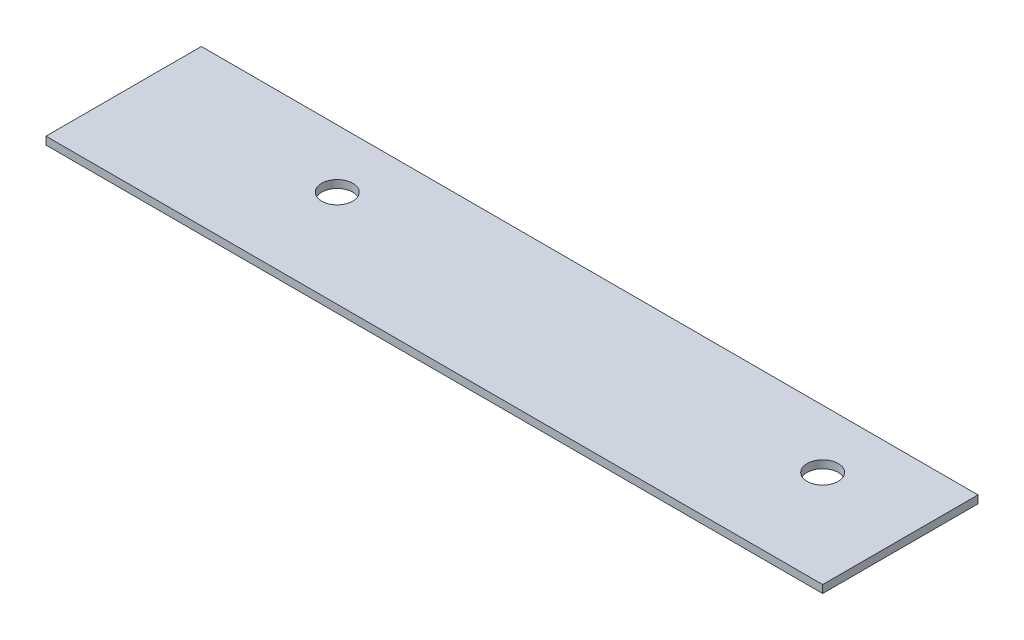
ISO-10303-21;
HEADER;
FILE_DESCRIPTION(('STEP AP214'),'2;1');
FILE_NAME('part.step','',(''),(''),'','','');
FILE_SCHEMA(('AUTOMOTIVE_DESIGN { 1 0 10303 214 1 1 1 1 }'));
ENDSEC;
DATA;
#1=APPLICATION_CONTEXT('core data for automotive mechanical design processes');
#2=APPLICATION_PROTOCOL_DEFINITION('international standard','automotive_design',2000,#1);
#3=PRODUCT_CONTEXT('',#1,'mechanical');
#4=PRODUCT('Part','Part','',(#3));
#5=PRODUCT_RELATED_PRODUCT_CATEGORY('part','',(#4));
#6=PRODUCT_DEFINITION_FORMATION('','',#4);
#7=PRODUCT_DEFINITION_CONTEXT('part definition',#1,'design');
#8=PRODUCT_DEFINITION('design','',#6,#7);
#9=PRODUCT_DEFINITION_SHAPE('','',#8);
#10=(LENGTH_UNIT() NAMED_UNIT(*) SI_UNIT(.MILLI.,.METRE.));
#11=(NAMED_UNIT(*) PLANE_ANGLE_UNIT() SI_UNIT($,.RADIAN.));
#12=(NAMED_UNIT(*) SI_UNIT($,.STERADIAN.) SOLID_ANGLE_UNIT());
#13=UNCERTAINTY_MEASURE_WITH_UNIT(LENGTH_MEASURE(1.E-05),#10,'distance_accuracy_value','');
#14=(GEOMETRIC_REPRESENTATION_CONTEXT(3) GLOBAL_UNCERTAINTY_ASSIGNED_CONTEXT((#13)) GLOBAL_UNIT_ASSIGNED_CONTEXT((#10,
#11,#12)) REPRESENTATION_CONTEXT('',''));
#15=CARTESIAN_POINT('',(0.,0.,0.));
#16=DIRECTION('',(0.,0.,1.));
#17=DIRECTION('',(1.,0.,0.));
#18=AXIS2_PLACEMENT_3D('',#15,#16,#17);
#19=CARTESIAN_POINT('',(0.,0.8,0.));
#20=DIRECTION('',(0.,-1.,0.));
#21=DIRECTION('',(0.,0.,-1.));
#22=AXIS2_PLACEMENT_3D('',#19,#20,#21);
#23=PLANE('',#22);
#24=DIRECTION('',(0.,0.,1.));
#25=VECTOR('',#24,1.);
#26=CARTESIAN_POINT('',(0.,0.8,0.));
#27=LINE('',#26,#25);
#28=CARTESIAN_POINT('',(0.,0.8,-16.));
#29=VERTEX_POINT('',#28);
#30=CARTESIAN_POINT('',(0.,0.8,0.));
#31=VERTEX_POINT('',#30);
#32=EDGE_CURVE('E85',#29,#31,#27,.T.);
#33=ORIENTED_EDGE('',*,*,#32,.T.);
#34=DIRECTION('',(1.,0.,0.));
#35=VECTOR('',#34,1.);
#36=CARTESIAN_POINT('',(0.,0.8,0.));
#37=LINE('',#36,#35);
#38=CARTESIAN_POINT('',(80.,0.8,0.));
#39=VERTEX_POINT('',#38);
#40=EDGE_CURVE('E80',#31,#39,#37,.T.);
#41=ORIENTED_EDGE('',*,*,#40,.T.);
#42=DIRECTION('',(0.,0.,-1.));
#43=VECTOR('',#42,1.);
#44=CARTESIAN_POINT('',(80.,0.8,0.));
#45=LINE('',#44,#43);
#46=CARTESIAN_POINT('',(80.,0.8,-16.));
#47=VERTEX_POINT('',#46);
#48=EDGE_CURVE('E83',#39,#47,#45,.T.);
#49=ORIENTED_EDGE('',*,*,#48,.T.);
#50=DIRECTION('',(-1.,0.,0.));
#51=VECTOR('',#50,1.);
#52=CARTESIAN_POINT('',(0.,0.8,-16.));
#53=LINE('',#52,#51);
#54=EDGE_CURVE('E50',#47,#29,#53,.T.);
#55=ORIENTED_EDGE('',*,*,#54,.T.);
#56=EDGE_LOOP('',(#33,#41,#49,#55));
#57=FACE_BOUND('',#56,.T.);
#58=CARTESIAN_POINT('',(20.,0.8,-10.));
#59=DIRECTION('',(0.,1.,0.));
#60=DIRECTION('',(0.,0.,1.));
#61=AXIS2_PLACEMENT_3D('',#58,#59,#60);
#62=CIRCLE('',#61,1.6);
#63=CARTESIAN_POINT('',(20.,0.8,-8.4));
#64=VERTEX_POINT('',#63);
#65=EDGE_CURVE('E100',#64,#64,#62,.T.);
#66=ORIENTED_EDGE('',*,*,#65,.F.);
#67=EDGE_LOOP('',(#66));
#68=FACE_BOUND('',#67,.T.);
#69=CARTESIAN_POINT('',(70.,0.8,-10.));
#70=DIRECTION('',(0.,1.,0.));
#71=DIRECTION('',(0.,0.,1.));
#72=AXIS2_PLACEMENT_3D('',#69,#70,#71);
#73=CIRCLE('',#72,1.6);
#74=CARTESIAN_POINT('',(70.,0.8,-8.4));
#75=VERTEX_POINT('',#74);
#76=EDGE_CURVE('E115',#75,#75,#73,.T.);
#77=ORIENTED_EDGE('',*,*,#76,.F.);
#78=EDGE_LOOP('',(#77));
#79=FACE_BOUND('',#78,.T.);
#80=ADVANCED_FACE('F33',(#57,#68,#79),#23,.F.);
#81=CARTESIAN_POINT('',(0.,0.,0.));
#82=DIRECTION('',(0.,-1.,0.));
#83=DIRECTION('',(0.,0.,-1.));
#84=AXIS2_PLACEMENT_3D('',#81,#82,#83);
#85=PLANE('',#84);
#86=CARTESIAN_POINT('',(20.,0.,-10.));
#87=DIRECTION('',(0.,1.,0.));
#88=DIRECTION('',(0.,0.,1.));
#89=AXIS2_PLACEMENT_3D('',#86,#87,#88);
#90=CIRCLE('',#89,1.6);
#91=CARTESIAN_POINT('',(20.,0.,-8.4));
#92=VERTEX_POINT('',#91);
#93=EDGE_CURVE('E112',#92,#92,#90,.T.);
#94=ORIENTED_EDGE('',*,*,#93,.T.);
#95=EDGE_LOOP('',(#94));
#96=FACE_BOUND('',#95,.T.);
#97=DIRECTION('',(0.,0.,1.));
#98=VECTOR('',#97,1.);
#99=CARTESIAN_POINT('',(0.,0.,0.));
#100=LINE('',#99,#98);
#101=CARTESIAN_POINT('',(0.,0.,-16.));
#102=VERTEX_POINT('',#101);
#103=CARTESIAN_POINT('',(0.,0.,0.));
#104=VERTEX_POINT('',#103);
#105=EDGE_CURVE('E97',#102,#104,#100,.T.);
#106=ORIENTED_EDGE('',*,*,#105,.F.);
#107=DIRECTION('',(-1.,0.,0.));
#108=VECTOR('',#107,1.);
#109=CARTESIAN_POINT('',(0.,0.,-16.));
#110=LINE('',#109,#108);
#111=CARTESIAN_POINT('',(80.,0.,-16.));
#112=VERTEX_POINT('',#111);
#113=EDGE_CURVE('E73',#112,#102,#110,.T.);
#114=ORIENTED_EDGE('',*,*,#113,.F.);
#115=DIRECTION('',(0.,0.,-1.));
#116=VECTOR('',#115,1.);
#117=CARTESIAN_POINT('',(80.,0.,0.));
#118=LINE('',#117,#116);
#119=CARTESIAN_POINT('',(80.,0.,0.));
#120=VERTEX_POINT('',#119);
#121=EDGE_CURVE('E67',#120,#112,#118,.T.);
#122=ORIENTED_EDGE('',*,*,#121,.F.);
#123=DIRECTION('',(1.,0.,0.));
#124=VECTOR('',#123,1.);
#125=CARTESIAN_POINT('',(0.,0.,0.));
#126=LINE('',#125,#124);
#127=EDGE_CURVE('E89',#104,#120,#126,.T.);
#128=ORIENTED_EDGE('',*,*,#127,.F.);
#129=EDGE_LOOP('',(#106,#114,#122,#128));
#130=FACE_BOUND('',#129,.T.);
#131=CARTESIAN_POINT('',(70.,0.,-10.));
#132=DIRECTION('',(0.,1.,0.));
#133=DIRECTION('',(0.,0.,1.));
#134=AXIS2_PLACEMENT_3D('',#131,#132,#133);
#135=CIRCLE('',#134,1.6);
#136=CARTESIAN_POINT('',(70.,0.,-8.4));
#137=VERTEX_POINT('',#136);
#138=EDGE_CURVE('E118',#137,#137,#135,.T.);
#139=ORIENTED_EDGE('',*,*,#138,.T.);
#140=EDGE_LOOP('',(#139));
#141=FACE_BOUND('',#140,.T.);
#142=ADVANCED_FACE('F108',(#96,#130,#141),#85,.T.);
#143=CARTESIAN_POINT('',(0.,0.8,0.));
#144=DIRECTION('',(1.,0.,0.));
#145=DIRECTION('',(0.,0.,-1.));
#146=AXIS2_PLACEMENT_3D('',#143,#144,#145);
#147=PLANE('',#146);
#148=ORIENTED_EDGE('',*,*,#105,.T.);
#149=DIRECTION('',(0.,-1.,0.));
#150=VECTOR('',#149,1.);
#151=CARTESIAN_POINT('',(0.,0.8,0.));
#152=LINE('',#151,#150);
#153=EDGE_CURVE('E11',#31,#104,#152,.T.);
#154=ORIENTED_EDGE('',*,*,#153,.F.);
#155=ORIENTED_EDGE('',*,*,#32,.F.);
#156=DIRECTION('',(0.,-1.,0.));
#157=VECTOR('',#156,1.);
#158=CARTESIAN_POINT('',(0.,0.8,-16.));
#159=LINE('',#158,#157);
#160=EDGE_CURVE('E93',#29,#102,#159,.T.);
#161=ORIENTED_EDGE('',*,*,#160,.T.);
#162=EDGE_LOOP('',(#148,#154,#155,#161));
#163=FACE_BOUND('',#162,.T.);
#164=ADVANCED_FACE('F35',(#163),#147,.F.);
#165=CARTESIAN_POINT('',(0.,0.8,0.));
#166=DIRECTION('',(0.,0.,-1.));
#167=DIRECTION('',(-1.,0.,0.));
#168=AXIS2_PLACEMENT_3D('',#165,#166,#167);
#169=PLANE('',#168);
#170=ORIENTED_EDGE('',*,*,#127,.T.);
#171=DIRECTION('',(0.,-1.,0.));
#172=VECTOR('',#171,1.);
#173=CARTESIAN_POINT('',(80.,0.8,0.));
#174=LINE('',#173,#172);
#175=EDGE_CURVE('E42',#39,#120,#174,.T.);
#176=ORIENTED_EDGE('',*,*,#175,.F.);
#177=ORIENTED_EDGE('',*,*,#40,.F.);
#178=ORIENTED_EDGE('',*,*,#153,.T.);
#179=EDGE_LOOP('',(#170,#176,#177,#178));
#180=FACE_BOUND('',#179,.T.);
#181=ADVANCED_FACE('F88',(#180),#169,.F.);
#182=CARTESIAN_POINT('',(80.,0.8,0.));
#183=DIRECTION('',(-1.,0.,0.));
#184=DIRECTION('',(0.,0.,1.));
#185=AXIS2_PLACEMENT_3D('',#182,#183,#184);
#186=PLANE('',#185);
#187=ORIENTED_EDGE('',*,*,#121,.T.);
#188=DIRECTION('',(0.,-1.,0.));
#189=VECTOR('',#188,1.);
#190=CARTESIAN_POINT('',(80.,0.8,-16.));
#191=LINE('',#190,#189);
#192=EDGE_CURVE('E90',#47,#112,#191,.T.);
#193=ORIENTED_EDGE('',*,*,#192,.F.);
#194=ORIENTED_EDGE('',*,*,#48,.F.);
#195=ORIENTED_EDGE('',*,*,#175,.T.);
#196=EDGE_LOOP('',(#187,#193,#194,#195));
#197=FACE_BOUND('',#196,.T.);
#198=ADVANCED_FACE('F91',(#197),#186,.F.);
#199=CARTESIAN_POINT('',(0.,0.8,-16.));
#200=DIRECTION('',(0.,0.,1.));
#201=DIRECTION('',(1.,0.,0.));
#202=AXIS2_PLACEMENT_3D('',#199,#200,#201);
#203=PLANE('',#202);
#204=ORIENTED_EDGE('',*,*,#113,.T.);
#205=ORIENTED_EDGE('',*,*,#160,.F.);
#206=ORIENTED_EDGE('',*,*,#54,.F.);
#207=ORIENTED_EDGE('',*,*,#192,.T.);
#208=EDGE_LOOP('',(#204,#205,#206,#207));
#209=FACE_BOUND('',#208,.T.);
#210=ADVANCED_FACE('F105',(#209),#203,.F.);
#211=CARTESIAN_POINT('',(20.,0.8,-10.));
#212=DIRECTION('',(0.,-1.,0.));
#213=DIRECTION('',(0.,0.,-1.));
#214=AXIS2_PLACEMENT_3D('',#211,#212,#213);
#215=CYLINDRICAL_SURFACE('',#214,1.6);
#216=ORIENTED_EDGE('',*,*,#65,.T.);
#217=EDGE_LOOP('',(#216));
#218=FACE_BOUND('',#217,.T.);
#219=ORIENTED_EDGE('',*,*,#93,.F.);
#220=EDGE_LOOP('',(#219));
#221=FACE_BOUND('',#220,.T.);
#222=ADVANCED_FACE('F135',(#218,#221),#215,.F.);
#223=CARTESIAN_POINT('',(70.,0.8,-10.));
#224=DIRECTION('',(0.,-1.,0.));
#225=DIRECTION('',(0.,0.,-1.));
#226=AXIS2_PLACEMENT_3D('',#223,#224,#225);
#227=CYLINDRICAL_SURFACE('',#226,1.6);
#228=ORIENTED_EDGE('',*,*,#76,.T.);
#229=EDGE_LOOP('',(#228));
#230=FACE_BOUND('',#229,.T.);
#231=ORIENTED_EDGE('',*,*,#138,.F.);
#232=EDGE_LOOP('',(#231));
#233=FACE_BOUND('',#232,.T.);
#234=ADVANCED_FACE('F124',(#230,#233),#227,.F.);
#235=CLOSED_SHELL('',(#80,#142,#164,#181,#198,#210,#222,#234));
#236=MANIFOLD_SOLID_BREP('B2',#235);
#237=ADVANCED_BREP_SHAPE_REPRESENTATION('',(#18,#236),#14);
#238=SHAPE_DEFINITION_REPRESENTATION(#9,#237);
ENDSEC;
END-ISO-10303-21;
